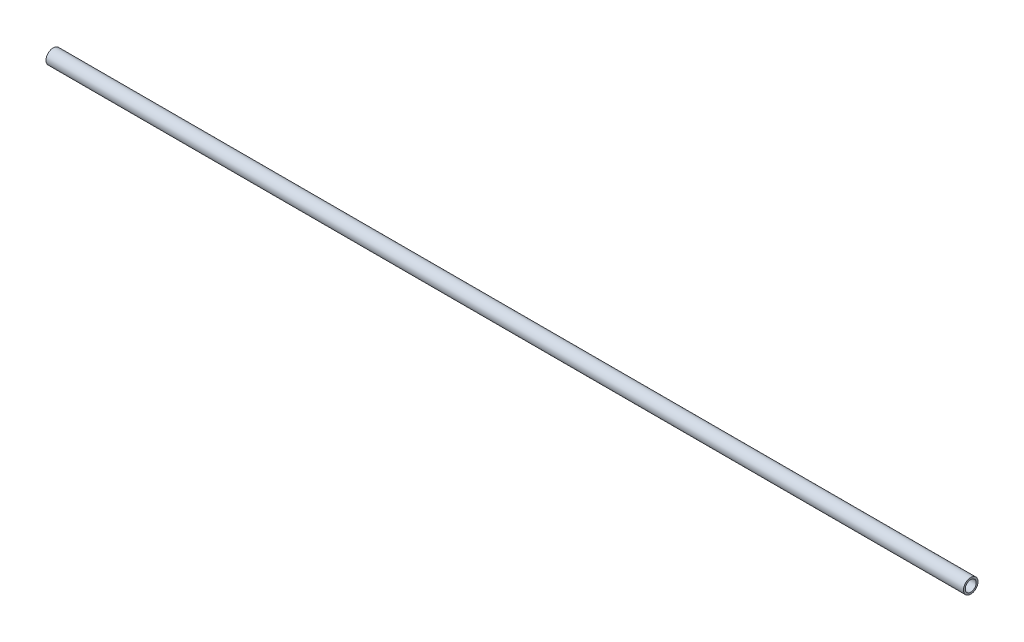
ISO-10303-21;
HEADER;
FILE_DESCRIPTION(('STEP AP214'),'2;1');
FILE_NAME('part.step','',(''),(''),'','','');
FILE_SCHEMA(('AUTOMOTIVE_DESIGN { 1 0 10303 214 1 1 1 1 }'));
ENDSEC;
DATA;
#1=APPLICATION_CONTEXT('core data for automotive mechanical design processes');
#2=APPLICATION_PROTOCOL_DEFINITION('international standard','automotive_design',2000,#1);
#3=PRODUCT_CONTEXT('',#1,'mechanical');
#4=PRODUCT('Part','Part','',(#3));
#5=PRODUCT_RELATED_PRODUCT_CATEGORY('part','',(#4));
#6=PRODUCT_DEFINITION_FORMATION('','',#4);
#7=PRODUCT_DEFINITION_CONTEXT('part definition',#1,'design');
#8=PRODUCT_DEFINITION('design','',#6,#7);
#9=PRODUCT_DEFINITION_SHAPE('','',#8);
#10=(LENGTH_UNIT() NAMED_UNIT(*) SI_UNIT(.MILLI.,.METRE.));
#11=(NAMED_UNIT(*) PLANE_ANGLE_UNIT() SI_UNIT($,.RADIAN.));
#12=(NAMED_UNIT(*) SI_UNIT($,.STERADIAN.) SOLID_ANGLE_UNIT());
#13=UNCERTAINTY_MEASURE_WITH_UNIT(LENGTH_MEASURE(1.E-05),#10,'distance_accuracy_value','');
#14=(GEOMETRIC_REPRESENTATION_CONTEXT(3) GLOBAL_UNCERTAINTY_ASSIGNED_CONTEXT((#13)) GLOBAL_UNIT_ASSIGNED_CONTEXT((#10,
#11,#12)) REPRESENTATION_CONTEXT('',''));
#15=CARTESIAN_POINT('',(0.,0.,0.));
#16=DIRECTION('',(0.,0.,1.));
#17=DIRECTION('',(1.,0.,0.));
#18=AXIS2_PLACEMENT_3D('',#15,#16,#17);
#19=CARTESIAN_POINT('',(1016.,0.,0.));
#20=DIRECTION('',(1.,0.,0.));
#21=DIRECTION('',(0.,0.,-1.));
#22=AXIS2_PLACEMENT_3D('',#19,#20,#21);
#23=PLANE('',#22);
#24=CARTESIAN_POINT('',(1016.,0.,0.));
#25=DIRECTION('',(1.,0.,0.));
#26=DIRECTION('',(0.,0.,-1.));
#27=AXIS2_PLACEMENT_3D('',#24,#25,#26);
#28=CIRCLE('',#27,8.);
#29=CARTESIAN_POINT('',(1016.,0.,-8.));
#30=VERTEX_POINT('',#29);
#31=EDGE_CURVE('E10',#30,#30,#28,.T.);
#32=ORIENTED_EDGE('',*,*,#31,.T.);
#33=EDGE_LOOP('',(#32));
#34=FACE_BOUND('',#33,.T.);
#35=CARTESIAN_POINT('',(1016.,0.,0.));
#36=DIRECTION('',(1.,0.,0.));
#37=DIRECTION('',(0.,0.,-1.));
#38=AXIS2_PLACEMENT_3D('',#35,#36,#37);
#39=CIRCLE('',#38,6.);
#40=CARTESIAN_POINT('',(1016.,0.,-6.));
#41=VERTEX_POINT('',#40);
#42=EDGE_CURVE('E45',#41,#41,#39,.T.);
#43=ORIENTED_EDGE('',*,*,#42,.F.);
#44=EDGE_LOOP('',(#43));
#45=FACE_BOUND('',#44,.T.);
#46=ADVANCED_FACE('F37',(#34,#45),#23,.T.);
#47=CARTESIAN_POINT('',(1016.,0.,0.));
#48=DIRECTION('',(-1.,0.,0.));
#49=DIRECTION('',(0.,0.,1.));
#50=AXIS2_PLACEMENT_3D('',#47,#48,#49);
#51=CYLINDRICAL_SURFACE('',#50,8.);
#52=ORIENTED_EDGE('',*,*,#31,.F.);
#53=EDGE_LOOP('',(#52));
#54=FACE_BOUND('',#53,.T.);
#55=CARTESIAN_POINT('',(6.35000000000008,0.,0.));
#56=DIRECTION('',(1.,0.,0.));
#57=DIRECTION('',(0.,0.,-1.));
#58=AXIS2_PLACEMENT_3D('',#55,#56,#57);
#59=CIRCLE('',#58,8.);
#60=CARTESIAN_POINT('',(6.35000000000008,0.,-8.));
#61=VERTEX_POINT('',#60);
#62=EDGE_CURVE('E49',#61,#61,#59,.T.);
#63=ORIENTED_EDGE('',*,*,#62,.T.);
#64=EDGE_LOOP('',(#63));
#65=FACE_BOUND('',#64,.T.);
#66=ADVANCED_FACE('F39',(#54,#65),#51,.T.);
#67=CARTESIAN_POINT('',(1016.,0.,0.));
#68=DIRECTION('',(-1.,0.,0.));
#69=DIRECTION('',(0.,0.,1.));
#70=AXIS2_PLACEMENT_3D('',#67,#68,#69);
#71=CYLINDRICAL_SURFACE('',#70,6.);
#72=CARTESIAN_POINT('',(6.35000000000008,0.,0.));
#73=DIRECTION('',(1.,0.,0.));
#74=DIRECTION('',(0.,0.,-1.));
#75=AXIS2_PLACEMENT_3D('',#72,#73,#74);
#76=CIRCLE('',#75,6.);
#77=CARTESIAN_POINT('',(6.35000000000008,0.,-6.));
#78=VERTEX_POINT('',#77);
#79=EDGE_CURVE('E41',#78,#78,#76,.T.);
#80=ORIENTED_EDGE('',*,*,#79,.F.);
#81=EDGE_LOOP('',(#80));
#82=FACE_BOUND('',#81,.T.);
#83=ORIENTED_EDGE('',*,*,#42,.T.);
#84=EDGE_LOOP('',(#83));
#85=FACE_BOUND('',#84,.T.);
#86=ADVANCED_FACE('F61',(#82,#85),#71,.F.);
#87=CARTESIAN_POINT('',(6.35,-8.,-45.5309554830123));
#88=DIRECTION('',(1.,0.,0.));
#89=DIRECTION('',(0.,0.,-1.));
#90=AXIS2_PLACEMENT_3D('',#87,#88,#89);
#91=PLANE('',#90);
#92=ORIENTED_EDGE('',*,*,#79,.T.);
#93=EDGE_LOOP('',(#92));
#94=FACE_BOUND('',#93,.T.);
#95=ORIENTED_EDGE('',*,*,#62,.F.);
#96=EDGE_LOOP('',(#95));
#97=FACE_BOUND('',#96,.T.);
#98=ADVANCED_FACE('F58',(#94,#97),#91,.F.);
#99=CLOSED_SHELL('',(#46,#66,#86,#98));
#100=MANIFOLD_SOLID_BREP('B2',#99);
#101=ADVANCED_BREP_SHAPE_REPRESENTATION('',(#18,#100),#14);
#102=SHAPE_DEFINITION_REPRESENTATION(#9,#101);
ENDSEC;
END-ISO-10303-21;
